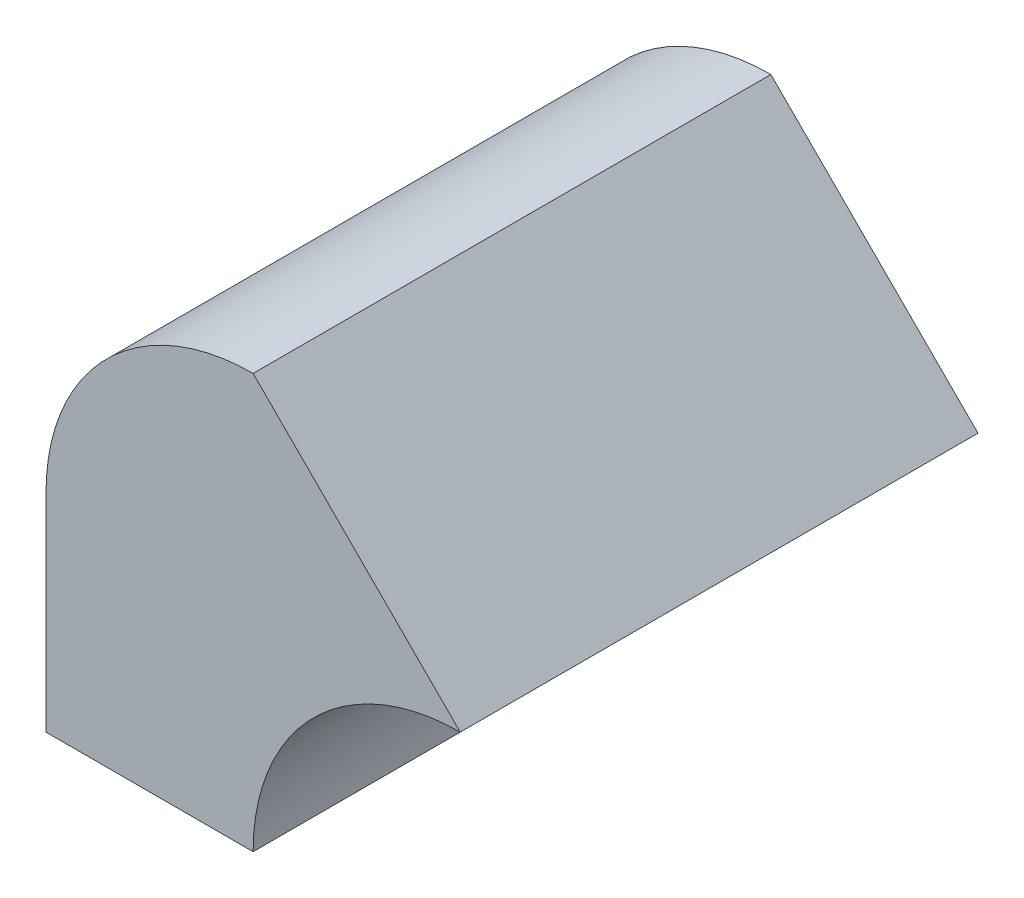
ISO-10303-21;
HEADER;
FILE_DESCRIPTION(('STEP AP214'),'2;1');
FILE_NAME('part.step','',(''),(''),'','','');
FILE_SCHEMA(('AUTOMOTIVE_DESIGN { 1 0 10303 214 1 1 1 1 }'));
ENDSEC;
DATA;
#1=APPLICATION_CONTEXT('core data for automotive mechanical design processes');
#2=APPLICATION_PROTOCOL_DEFINITION('international standard','automotive_design',2000,#1);
#3=PRODUCT_CONTEXT('',#1,'mechanical');
#4=PRODUCT('Part','Part','',(#3));
#5=PRODUCT_RELATED_PRODUCT_CATEGORY('part','',(#4));
#6=PRODUCT_DEFINITION_FORMATION('','',#4);
#7=PRODUCT_DEFINITION_CONTEXT('part definition',#1,'design');
#8=PRODUCT_DEFINITION('design','',#6,#7);
#9=PRODUCT_DEFINITION_SHAPE('','',#8);
#10=(LENGTH_UNIT() NAMED_UNIT(*) SI_UNIT(.MILLI.,.METRE.));
#11=(NAMED_UNIT(*) PLANE_ANGLE_UNIT() SI_UNIT($,.RADIAN.));
#12=(NAMED_UNIT(*) SI_UNIT($,.STERADIAN.) SOLID_ANGLE_UNIT());
#13=UNCERTAINTY_MEASURE_WITH_UNIT(LENGTH_MEASURE(1.E-05),#10,'distance_accuracy_value','');
#14=(GEOMETRIC_REPRESENTATION_CONTEXT(3) GLOBAL_UNCERTAINTY_ASSIGNED_CONTEXT((#13)) GLOBAL_UNIT_ASSIGNED_CONTEXT((#10,
#11,#12)) REPRESENTATION_CONTEXT('',''));
#15=CARTESIAN_POINT('',(0.,0.,0.));
#16=DIRECTION('',(0.,0.,1.));
#17=DIRECTION('',(1.,0.,0.));
#18=AXIS2_PLACEMENT_3D('',#15,#16,#17);
#19=CARTESIAN_POINT('',(0.,-10.,25.));
#20=DIRECTION('',(0.,1.,0.));
#21=DIRECTION('',(0.,0.,1.));
#22=AXIS2_PLACEMENT_3D('',#19,#20,#21);
#23=PLANE('',#22);
#24=DIRECTION('',(1.,0.,0.));
#25=VECTOR('',#24,1.);
#26=CARTESIAN_POINT('',(0.,-10.,0.));
#27=LINE('',#26,#25);
#28=CARTESIAN_POINT('',(0.,-10.,0.));
#29=VERTEX_POINT('',#28);
#30=CARTESIAN_POINT('',(10.,-10.,0.));
#31=VERTEX_POINT('',#30);
#32=EDGE_CURVE('E107',#29,#31,#27,.T.);
#33=ORIENTED_EDGE('',*,*,#32,.T.);
#34=DIRECTION('',(0.,0.,-1.));
#35=VECTOR('',#34,1.);
#36=CARTESIAN_POINT('',(10.,-10.,25.));
#37=LINE('',#36,#35);
#38=CARTESIAN_POINT('',(10.,-10.,25.));
#39=VERTEX_POINT('',#38);
#40=EDGE_CURVE('E11',#39,#31,#37,.T.);
#41=ORIENTED_EDGE('',*,*,#40,.F.);
#42=DIRECTION('',(1.,0.,0.));
#43=VECTOR('',#42,1.);
#44=CARTESIAN_POINT('',(0.,-10.,25.));
#45=LINE('',#44,#43);
#46=CARTESIAN_POINT('',(0.,-10.,25.));
#47=VERTEX_POINT('',#46);
#48=EDGE_CURVE('E115',#47,#39,#45,.T.);
#49=ORIENTED_EDGE('',*,*,#48,.F.);
#50=DIRECTION('',(0.,0.,-1.));
#51=VECTOR('',#50,1.);
#52=CARTESIAN_POINT('',(0.,-10.,25.));
#53=LINE('',#52,#51);
#54=EDGE_CURVE('E103',#47,#29,#53,.T.);
#55=ORIENTED_EDGE('',*,*,#54,.T.);
#56=EDGE_LOOP('',(#33,#41,#49,#55));
#57=FACE_BOUND('',#56,.T.);
#58=ADVANCED_FACE('F33',(#57),#23,.F.);
#59=CARTESIAN_POINT('',(20.,-10.,25.));
#60=DIRECTION('',(0.,0.,-1.));
#61=DIRECTION('',(-1.,0.,0.));
#62=AXIS2_PLACEMENT_3D('',#59,#60,#61);
#63=CYLINDRICAL_SURFACE('',#62,10.);
#64=CARTESIAN_POINT('',(20.,-10.,0.));
#65=DIRECTION('',(0.,0.,-1.));
#66=DIRECTION('',(-1.,0.,0.));
#67=AXIS2_PLACEMENT_3D('',#64,#65,#66);
#68=CIRCLE('',#67,10.);
#69=CARTESIAN_POINT('',(20.,0.,0.));
#70=VERTEX_POINT('',#69);
#71=EDGE_CURVE('E110',#31,#70,#68,.T.);
#72=ORIENTED_EDGE('',*,*,#71,.T.);
#73=DIRECTION('',(0.,0.,-1.));
#74=VECTOR('',#73,1.);
#75=CARTESIAN_POINT('',(20.,0.,25.));
#76=LINE('',#75,#74);
#77=CARTESIAN_POINT('',(20.,0.,25.));
#78=VERTEX_POINT('',#77);
#79=EDGE_CURVE('E41',#78,#70,#76,.T.);
#80=ORIENTED_EDGE('',*,*,#79,.F.);
#81=CARTESIAN_POINT('',(20.,-10.,25.));
#82=DIRECTION('',(0.,0.,-1.));
#83=DIRECTION('',(-1.,0.,0.));
#84=AXIS2_PLACEMENT_3D('',#81,#82,#83);
#85=CIRCLE('',#84,10.);
#86=EDGE_CURVE('E83',#39,#78,#85,.T.);
#87=ORIENTED_EDGE('',*,*,#86,.F.);
#88=ORIENTED_EDGE('',*,*,#40,.T.);
#89=EDGE_LOOP('',(#72,#80,#87,#88));
#90=FACE_BOUND('',#89,.T.);
#91=ADVANCED_FACE('F134',(#90),#63,.F.);
#92=CARTESIAN_POINT('',(20.,0.,25.));
#93=DIRECTION('',(-0.707106781186548,-0.707106781186548,0.));
#94=DIRECTION('',(0.707106781186548,-0.707106781186548,0.));
#95=AXIS2_PLACEMENT_3D('',#92,#93,#94);
#96=PLANE('',#95);
#97=DIRECTION('',(-0.707106781186548,0.707106781186548,0.));
#98=VECTOR('',#97,1.);
#99=CARTESIAN_POINT('',(20.,0.,0.));
#100=LINE('',#99,#98);
#101=CARTESIAN_POINT('',(10.,10.,0.));
#102=VERTEX_POINT('',#101);
#103=EDGE_CURVE('E98',#70,#102,#100,.T.);
#104=ORIENTED_EDGE('',*,*,#103,.T.);
#105=DIRECTION('',(0.,0.,-1.));
#106=VECTOR('',#105,1.);
#107=CARTESIAN_POINT('',(10.,10.,25.));
#108=LINE('',#107,#106);
#109=CARTESIAN_POINT('',(10.,10.,25.));
#110=VERTEX_POINT('',#109);
#111=EDGE_CURVE('E95',#110,#102,#108,.T.);
#112=ORIENTED_EDGE('',*,*,#111,.F.);
#113=DIRECTION('',(-0.707106781186548,0.707106781186548,0.));
#114=VECTOR('',#113,1.);
#115=CARTESIAN_POINT('',(20.,0.,25.));
#116=LINE('',#115,#114);
#117=EDGE_CURVE('E87',#78,#110,#116,.T.);
#118=ORIENTED_EDGE('',*,*,#117,.F.);
#119=ORIENTED_EDGE('',*,*,#79,.T.);
#120=EDGE_LOOP('',(#104,#112,#118,#119));
#121=FACE_BOUND('',#120,.T.);
#122=ADVANCED_FACE('F96',(#121),#96,.F.);
#123=CARTESIAN_POINT('',(10.,0.,25.));
#124=DIRECTION('',(0.,0.,-1.));
#125=DIRECTION('',(-1.,0.,0.));
#126=AXIS2_PLACEMENT_3D('',#123,#124,#125);
#127=CYLINDRICAL_SURFACE('',#126,10.);
#128=CARTESIAN_POINT('',(10.,0.,0.));
#129=DIRECTION('',(0.,0.,1.));
#130=DIRECTION('',(-1.,0.,0.));
#131=AXIS2_PLACEMENT_3D('',#128,#129,#130);
#132=CIRCLE('',#131,10.);
#133=CARTESIAN_POINT('',(0.,0.,0.));
#134=VERTEX_POINT('',#133);
#135=EDGE_CURVE('E69',#102,#134,#132,.T.);
#136=ORIENTED_EDGE('',*,*,#135,.T.);
#137=DIRECTION('',(0.,0.,-1.));
#138=VECTOR('',#137,1.);
#139=CARTESIAN_POINT('',(0.,0.,25.));
#140=LINE('',#139,#138);
#141=CARTESIAN_POINT('',(0.,0.,25.));
#142=VERTEX_POINT('',#141);
#143=EDGE_CURVE('E99',#142,#134,#140,.T.);
#144=ORIENTED_EDGE('',*,*,#143,.F.);
#145=CARTESIAN_POINT('',(10.,0.,25.));
#146=DIRECTION('',(0.,0.,1.));
#147=DIRECTION('',(-1.,0.,0.));
#148=AXIS2_PLACEMENT_3D('',#145,#146,#147);
#149=CIRCLE('',#148,10.);
#150=EDGE_CURVE('E91',#110,#142,#149,.T.);
#151=ORIENTED_EDGE('',*,*,#150,.F.);
#152=ORIENTED_EDGE('',*,*,#111,.T.);
#153=EDGE_LOOP('',(#136,#144,#151,#152));
#154=FACE_BOUND('',#153,.T.);
#155=ADVANCED_FACE('F101',(#154),#127,.T.);
#156=CARTESIAN_POINT('',(0.,-10.,25.));
#157=DIRECTION('',(1.,0.,0.));
#158=DIRECTION('',(0.,0.,-1.));
#159=AXIS2_PLACEMENT_3D('',#156,#157,#158);
#160=PLANE('',#159);
#161=DIRECTION('',(0.,-1.,0.));
#162=VECTOR('',#161,1.);
#163=CARTESIAN_POINT('',(0.,-10.,0.));
#164=LINE('',#163,#162);
#165=EDGE_CURVE('E75',#134,#29,#164,.T.);
#166=ORIENTED_EDGE('',*,*,#165,.T.);
#167=ORIENTED_EDGE('',*,*,#54,.F.);
#168=DIRECTION('',(0.,-1.,0.));
#169=VECTOR('',#168,1.);
#170=CARTESIAN_POINT('',(0.,-10.,25.));
#171=LINE('',#170,#169);
#172=EDGE_CURVE('E49',#142,#47,#171,.T.);
#173=ORIENTED_EDGE('',*,*,#172,.F.);
#174=ORIENTED_EDGE('',*,*,#143,.T.);
#175=EDGE_LOOP('',(#166,#167,#173,#174));
#176=FACE_BOUND('',#175,.T.);
#177=ADVANCED_FACE('F123',(#176),#160,.F.);
#178=CARTESIAN_POINT('',(20.,-10.,25.));
#179=DIRECTION('',(0.,0.,-1.));
#180=DIRECTION('',(-1.,0.,0.));
#181=AXIS2_PLACEMENT_3D('',#178,#179,#180);
#182=PLANE('',#181);
#183=ORIENTED_EDGE('',*,*,#48,.T.);
#184=ORIENTED_EDGE('',*,*,#86,.T.);
#185=ORIENTED_EDGE('',*,*,#117,.T.);
#186=ORIENTED_EDGE('',*,*,#150,.T.);
#187=ORIENTED_EDGE('',*,*,#172,.T.);
#188=EDGE_LOOP('',(#183,#184,#185,#186,#187));
#189=FACE_BOUND('',#188,.T.);
#190=ADVANCED_FACE('F89',(#189),#182,.F.);
#191=CARTESIAN_POINT('',(20.,-10.,0.));
#192=DIRECTION('',(0.,0.,-1.));
#193=DIRECTION('',(-1.,0.,0.));
#194=AXIS2_PLACEMENT_3D('',#191,#192,#193);
#195=PLANE('',#194);
#196=ORIENTED_EDGE('',*,*,#32,.F.);
#197=ORIENTED_EDGE('',*,*,#165,.F.);
#198=ORIENTED_EDGE('',*,*,#135,.F.);
#199=ORIENTED_EDGE('',*,*,#103,.F.);
#200=ORIENTED_EDGE('',*,*,#71,.F.);
#201=EDGE_LOOP('',(#196,#197,#198,#199,#200));
#202=FACE_BOUND('',#201,.T.);
#203=ADVANCED_FACE('F119',(#202),#195,.T.);
#204=CLOSED_SHELL('',(#58,#91,#122,#155,#177,#190,#203));
#205=MANIFOLD_SOLID_BREP('B2',#204);
#206=ADVANCED_BREP_SHAPE_REPRESENTATION('',(#18,#205),#14);
#207=SHAPE_DEFINITION_REPRESENTATION(#9,#206);
ENDSEC;
END-ISO-10303-21;
